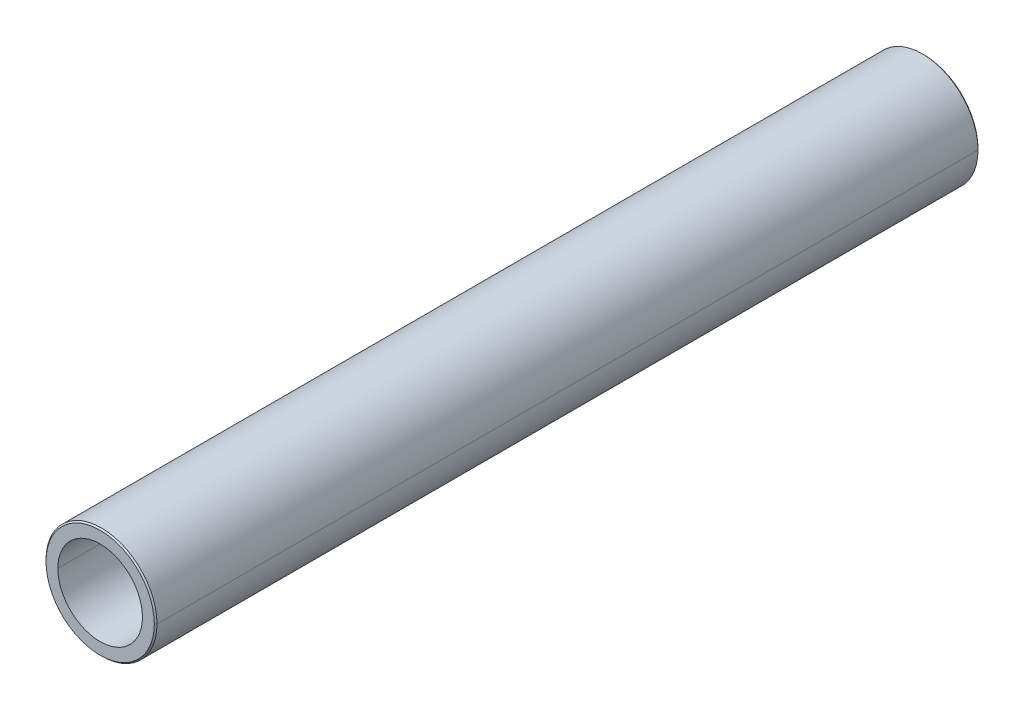
ISO-10303-21;
HEADER;
FILE_DESCRIPTION(('STEP AP214'),'2;1');
FILE_NAME('part.step','',(''),(''),'','','');
FILE_SCHEMA(('AUTOMOTIVE_DESIGN { 1 0 10303 214 1 1 1 1 }'));
ENDSEC;
DATA;
#1=APPLICATION_CONTEXT('core data for automotive mechanical design processes');
#2=APPLICATION_PROTOCOL_DEFINITION('international standard','automotive_design',2000,#1);
#3=PRODUCT_CONTEXT('',#1,'mechanical');
#4=PRODUCT('Part','Part','',(#3));
#5=PRODUCT_RELATED_PRODUCT_CATEGORY('part','',(#4));
#6=PRODUCT_DEFINITION_FORMATION('','',#4);
#7=PRODUCT_DEFINITION_CONTEXT('part definition',#1,'design');
#8=PRODUCT_DEFINITION('design','',#6,#7);
#9=PRODUCT_DEFINITION_SHAPE('','',#8);
#10=(LENGTH_UNIT() NAMED_UNIT(*) SI_UNIT(.MILLI.,.METRE.));
#11=(NAMED_UNIT(*) PLANE_ANGLE_UNIT() SI_UNIT($,.RADIAN.));
#12=(NAMED_UNIT(*) SI_UNIT($,.STERADIAN.) SOLID_ANGLE_UNIT());
#13=UNCERTAINTY_MEASURE_WITH_UNIT(LENGTH_MEASURE(1.E-05),#10,'distance_accuracy_value','');
#14=(GEOMETRIC_REPRESENTATION_CONTEXT(3) GLOBAL_UNCERTAINTY_ASSIGNED_CONTEXT((#13)) GLOBAL_UNIT_ASSIGNED_CONTEXT((#10,
#11,#12)) REPRESENTATION_CONTEXT('',''));
#15=CARTESIAN_POINT('',(0.,0.,0.));
#16=DIRECTION('',(0.,0.,1.));
#17=DIRECTION('',(1.,0.,0.));
#18=AXIS2_PLACEMENT_3D('',#15,#16,#17);
#19=CARTESIAN_POINT('',(0.,12.192,92.7354));
#20=DIRECTION('',(0.,0.,1.));
#21=DIRECTION('',(1.,0.,0.));
#22=AXIS2_PLACEMENT_3D('',#19,#20,#21);
#23=PLANE('',#22);
#24=CARTESIAN_POINT('',(0.,0.,92.7354));
#25=DIRECTION('',(0.,0.,-1.));
#26=DIRECTION('',(-1.,0.,0.));
#27=AXIS2_PLACEMENT_3D('',#24,#25,#26);
#28=CIRCLE('',#27,9.525);
#29=CARTESIAN_POINT('',(-9.525,0.,92.7354));
#30=VERTEX_POINT('',#29);
#31=CARTESIAN_POINT('',(9.525,0.,92.7354));
#32=VERTEX_POINT('',#31);
#33=EDGE_CURVE('E11',#30,#32,#28,.T.);
#34=ORIENTED_EDGE('',*,*,#33,.T.);
#35=CARTESIAN_POINT('',(0.,0.,92.7354));
#36=DIRECTION('',(0.,0.,-1.));
#37=DIRECTION('',(-1.,0.,0.));
#38=AXIS2_PLACEMENT_3D('',#35,#36,#37);
#39=CIRCLE('',#38,9.525);
#40=EDGE_CURVE('E25',#32,#30,#39,.T.);
#41=ORIENTED_EDGE('',*,*,#40,.T.);
#42=EDGE_LOOP('',(#34,#41));
#43=FACE_BOUND('',#42,.T.);
#44=CARTESIAN_POINT('',(0.,0.,92.7354));
#45=DIRECTION('',(0.,0.,-1.));
#46=DIRECTION('',(-1.,0.,0.));
#47=AXIS2_PLACEMENT_3D('',#44,#45,#46);
#48=CIRCLE('',#47,12.192);
#49=CARTESIAN_POINT('',(-12.192,0.,92.7354));
#50=VERTEX_POINT('',#49);
#51=CARTESIAN_POINT('',(12.1919999999992,0.,92.7353999999992));
#52=VERTEX_POINT('',#51);
#53=EDGE_CURVE('E147',#50,#52,#48,.T.);
#54=ORIENTED_EDGE('',*,*,#53,.F.);
#55=CARTESIAN_POINT('',(0.,0.,92.7354));
#56=DIRECTION('',(0.,0.,-1.));
#57=DIRECTION('',(-1.,0.,0.));
#58=AXIS2_PLACEMENT_3D('',#55,#56,#57);
#59=CIRCLE('',#58,12.192);
#60=EDGE_CURVE('E142',#52,#50,#59,.T.);
#61=ORIENTED_EDGE('',*,*,#60,.F.);
#62=EDGE_LOOP('',(#54,#61));
#63=FACE_BOUND('',#62,.T.);
#64=ADVANCED_FACE('F17',(#43,#63),#23,.T.);
#65=CARTESIAN_POINT('',(0.,0.,92.4306));
#66=DIRECTION('',(0.,0.,-1.));
#67=DIRECTION('',(0.,1.,0.));
#68=AXIS2_PLACEMENT_3D('',#65,#66,#67);
#69=CONICAL_SURFACE('',#68,12.4968,0.7853981634);
#70=ORIENTED_EDGE('',*,*,#60,.T.);
#71=DIRECTION('',(-0.707106781188373,0.,-0.707106781184722));
#72=VECTOR('',#71,1.);
#73=CARTESIAN_POINT('',(-12.1919999999992,0.,92.7353999999992));
#74=LINE('',#73,#72);
#75=CARTESIAN_POINT('',(-12.4968,0.,92.4306));
#76=VERTEX_POINT('',#75);
#77=EDGE_CURVE('E138',#50,#76,#74,.T.);
#78=ORIENTED_EDGE('',*,*,#77,.T.);
#79=CARTESIAN_POINT('',(0.,0.,92.4306));
#80=DIRECTION('',(0.,0.,-1.));
#81=DIRECTION('',(-1.,0.,0.));
#82=AXIS2_PLACEMENT_3D('',#79,#80,#81);
#83=CIRCLE('',#82,12.4968);
#84=CARTESIAN_POINT('',(12.4968,0.,92.4306));
#85=VERTEX_POINT('',#84);
#86=EDGE_CURVE('E133',#85,#76,#83,.T.);
#87=ORIENTED_EDGE('',*,*,#86,.F.);
#88=DIRECTION('',(0.707106781188373,0.,-0.707106781184722));
#89=VECTOR('',#88,1.);
#90=CARTESIAN_POINT('',(12.1919999999992,0.,92.7353999999992));
#91=LINE('',#90,#89);
#92=EDGE_CURVE('E128',#52,#85,#91,.T.);
#93=ORIENTED_EDGE('',*,*,#92,.F.);
#94=EDGE_LOOP('',(#70,#78,#87,#93));
#95=FACE_BOUND('',#94,.T.);
#96=ADVANCED_FACE('F163',(#95),#69,.T.);
#97=CARTESIAN_POINT('',(0.,0.,92.4306));
#98=DIRECTION('',(0.,0.,-1.));
#99=DIRECTION('',(0.,-1.,0.));
#100=AXIS2_PLACEMENT_3D('',#97,#98,#99);
#101=CONICAL_SURFACE('',#100,12.4968,0.7853981634);
#102=CARTESIAN_POINT('',(0.,0.,92.4306));
#103=DIRECTION('',(0.,0.,-1.));
#104=DIRECTION('',(-1.,0.,0.));
#105=AXIS2_PLACEMENT_3D('',#102,#103,#104);
#106=CIRCLE('',#105,12.4968);
#107=EDGE_CURVE('E123',#76,#85,#106,.T.);
#108=ORIENTED_EDGE('',*,*,#107,.F.);
#109=ORIENTED_EDGE('',*,*,#77,.F.);
#110=ORIENTED_EDGE('',*,*,#53,.T.);
#111=ORIENTED_EDGE('',*,*,#92,.T.);
#112=EDGE_LOOP('',(#108,#109,#110,#111));
#113=FACE_BOUND('',#112,.T.);
#114=ADVANCED_FACE('F159',(#113),#101,.T.);
#115=CARTESIAN_POINT('',(0.,0.,-92.7354));
#116=DIRECTION('',(0.,0.,1.));
#117=DIRECTION('',(0.,-1.,0.));
#118=AXIS2_PLACEMENT_3D('',#115,#116,#117);
#119=CYLINDRICAL_SURFACE('',#118,12.4968);
#120=CARTESIAN_POINT('',(0.,0.,-92.4306));
#121=DIRECTION('',(0.,0.,-1.));
#122=DIRECTION('',(-1.,0.,0.));
#123=AXIS2_PLACEMENT_3D('',#120,#121,#122);
#124=CIRCLE('',#123,12.4968);
#125=CARTESIAN_POINT('',(-12.4968,0.,-92.4306));
#126=VERTEX_POINT('',#125);
#127=CARTESIAN_POINT('',(12.4968000000008,0.,-92.4306000000008));
#128=VERTEX_POINT('',#127);
#129=EDGE_CURVE('E118',#126,#128,#124,.T.);
#130=ORIENTED_EDGE('',*,*,#129,.F.);
#131=DIRECTION('',(0.,0.,1.));
#132=VECTOR('',#131,1.);
#133=CARTESIAN_POINT('',(-12.4968,0.,-92.4306));
#134=LINE('',#133,#132);
#135=EDGE_CURVE('E113',#126,#76,#134,.T.);
#136=ORIENTED_EDGE('',*,*,#135,.T.);
#137=ORIENTED_EDGE('',*,*,#107,.T.);
#138=DIRECTION('',(0.,0.,1.));
#139=VECTOR('',#138,1.);
#140=CARTESIAN_POINT('',(12.4968,0.,-92.4306));
#141=LINE('',#140,#139);
#142=EDGE_CURVE('E108',#128,#85,#141,.T.);
#143=ORIENTED_EDGE('',*,*,#142,.F.);
#144=EDGE_LOOP('',(#130,#136,#137,#143));
#145=FACE_BOUND('',#144,.T.);
#146=ADVANCED_FACE('F169',(#145),#119,.T.);
#147=CARTESIAN_POINT('',(0.,0.,-92.7354));
#148=DIRECTION('',(0.,0.,1.));
#149=DIRECTION('',(0.,1.,0.));
#150=AXIS2_PLACEMENT_3D('',#147,#148,#149);
#151=CYLINDRICAL_SURFACE('',#150,12.4968);
#152=ORIENTED_EDGE('',*,*,#86,.T.);
#153=ORIENTED_EDGE('',*,*,#135,.F.);
#154=CARTESIAN_POINT('',(0.,0.,-92.4306));
#155=DIRECTION('',(0.,0.,-1.));
#156=DIRECTION('',(-1.,0.,0.));
#157=AXIS2_PLACEMENT_3D('',#154,#155,#156);
#158=CIRCLE('',#157,12.4968);
#159=EDGE_CURVE('E103',#128,#126,#158,.T.);
#160=ORIENTED_EDGE('',*,*,#159,.F.);
#161=ORIENTED_EDGE('',*,*,#142,.T.);
#162=EDGE_LOOP('',(#152,#153,#160,#161));
#163=FACE_BOUND('',#162,.T.);
#164=ADVANCED_FACE('F166',(#163),#151,.T.);
#165=CARTESIAN_POINT('',(0.,0.,-92.7354));
#166=DIRECTION('',(0.,0.,1.));
#167=DIRECTION('',(0.,1.,0.));
#168=AXIS2_PLACEMENT_3D('',#165,#166,#167);
#169=CONICAL_SURFACE('',#168,12.192,0.7853981634);
#170=ORIENTED_EDGE('',*,*,#159,.T.);
#171=DIRECTION('',(-0.707106781188373,0.,0.707106781184722));
#172=VECTOR('',#171,1.);
#173=CARTESIAN_POINT('',(-12.192,0.,-92.7354));
#174=LINE('',#173,#172);
#175=CARTESIAN_POINT('',(-12.192,0.,-92.7354));
#176=VERTEX_POINT('',#175);
#177=EDGE_CURVE('E98',#176,#126,#174,.T.);
#178=ORIENTED_EDGE('',*,*,#177,.F.);
#179=CARTESIAN_POINT('',(0.,0.,-92.7354));
#180=DIRECTION('',(0.,0.,-1.));
#181=DIRECTION('',(-1.,0.,0.));
#182=AXIS2_PLACEMENT_3D('',#179,#180,#181);
#183=CIRCLE('',#182,12.192);
#184=CARTESIAN_POINT('',(12.192,0.,-92.7354));
#185=VERTEX_POINT('',#184);
#186=EDGE_CURVE('E93',#185,#176,#183,.T.);
#187=ORIENTED_EDGE('',*,*,#186,.F.);
#188=DIRECTION('',(0.707106781188373,0.,0.707106781184722));
#189=VECTOR('',#188,1.);
#190=CARTESIAN_POINT('',(12.192,0.,-92.7354));
#191=LINE('',#190,#189);
#192=EDGE_CURVE('E82',#185,#128,#191,.T.);
#193=ORIENTED_EDGE('',*,*,#192,.T.);
#194=EDGE_LOOP('',(#170,#178,#187,#193));
#195=FACE_BOUND('',#194,.T.);
#196=ADVANCED_FACE('F175',(#195),#169,.T.);
#197=CARTESIAN_POINT('',(0.,0.,-92.7354));
#198=DIRECTION('',(0.,0.,1.));
#199=DIRECTION('',(0.,-1.,0.));
#200=AXIS2_PLACEMENT_3D('',#197,#198,#199);
#201=CONICAL_SURFACE('',#200,12.192,0.7853981634);
#202=CARTESIAN_POINT('',(0.,0.,-92.7354));
#203=DIRECTION('',(0.,0.,-1.));
#204=DIRECTION('',(-1.,0.,0.));
#205=AXIS2_PLACEMENT_3D('',#202,#203,#204);
#206=CIRCLE('',#205,12.192);
#207=EDGE_CURVE('E79',#176,#185,#206,.T.);
#208=ORIENTED_EDGE('',*,*,#207,.F.);
#209=ORIENTED_EDGE('',*,*,#177,.T.);
#210=ORIENTED_EDGE('',*,*,#129,.T.);
#211=ORIENTED_EDGE('',*,*,#192,.F.);
#212=EDGE_LOOP('',(#208,#209,#210,#211));
#213=FACE_BOUND('',#212,.T.);
#214=ADVANCED_FACE('F173',(#213),#201,.T.);
#215=CARTESIAN_POINT('',(0.,9.525,-92.7354));
#216=DIRECTION('',(0.,0.,-1.));
#217=DIRECTION('',(-1.,0.,0.));
#218=AXIS2_PLACEMENT_3D('',#215,#216,#217);
#219=PLANE('',#218);
#220=ORIENTED_EDGE('',*,*,#207,.T.);
#221=ORIENTED_EDGE('',*,*,#186,.T.);
#222=EDGE_LOOP('',(#220,#221));
#223=FACE_BOUND('',#222,.T.);
#224=CARTESIAN_POINT('',(0.,0.,-92.7354));
#225=DIRECTION('',(0.,0.,-1.));
#226=DIRECTION('',(-1.,0.,0.));
#227=AXIS2_PLACEMENT_3D('',#224,#225,#226);
#228=CIRCLE('',#227,9.525);
#229=CARTESIAN_POINT('',(-9.525,0.,-92.7354));
#230=VERTEX_POINT('',#229);
#231=CARTESIAN_POINT('',(9.525,0.,-92.7354));
#232=VERTEX_POINT('',#231);
#233=EDGE_CURVE('E68',#230,#232,#228,.T.);
#234=ORIENTED_EDGE('',*,*,#233,.F.);
#235=CARTESIAN_POINT('',(0.,0.,-92.7354));
#236=DIRECTION('',(0.,0.,-1.));
#237=DIRECTION('',(-1.,0.,0.));
#238=AXIS2_PLACEMENT_3D('',#235,#236,#237);
#239=CIRCLE('',#238,9.525);
#240=EDGE_CURVE('E64',#232,#230,#239,.T.);
#241=ORIENTED_EDGE('',*,*,#240,.F.);
#242=EDGE_LOOP('',(#234,#241));
#243=FACE_BOUND('',#242,.T.);
#244=ADVANCED_FACE('F66',(#223,#243),#219,.T.);
#245=CARTESIAN_POINT('',(0.,0.,-92.7354));
#246=DIRECTION('',(0.,0.,1.));
#247=DIRECTION('',(0.,1.,0.));
#248=AXIS2_PLACEMENT_3D('',#245,#246,#247);
#249=CYLINDRICAL_SURFACE('',#248,9.525);
#250=ORIENTED_EDGE('',*,*,#40,.F.);
#251=DIRECTION('',(0.,0.,1.));
#252=VECTOR('',#251,1.);
#253=CARTESIAN_POINT('',(9.525,0.,-92.7354));
#254=LINE('',#253,#252);
#255=EDGE_CURVE('E71',#232,#32,#254,.T.);
#256=ORIENTED_EDGE('',*,*,#255,.F.);
#257=ORIENTED_EDGE('',*,*,#240,.T.);
#258=DIRECTION('',(0.,0.,1.));
#259=VECTOR('',#258,1.);
#260=CARTESIAN_POINT('',(-9.525,0.,-92.7354));
#261=LINE('',#260,#259);
#262=EDGE_CURVE('E76',#230,#30,#261,.T.);
#263=ORIENTED_EDGE('',*,*,#262,.T.);
#264=EDGE_LOOP('',(#250,#256,#257,#263));
#265=FACE_BOUND('',#264,.T.);
#266=ADVANCED_FACE('F74',(#265),#249,.F.);
#267=CARTESIAN_POINT('',(0.,0.,-92.7354));
#268=DIRECTION('',(0.,0.,1.));
#269=DIRECTION('',(0.,-1.,0.));
#270=AXIS2_PLACEMENT_3D('',#267,#268,#269);
#271=CYLINDRICAL_SURFACE('',#270,9.525);
#272=ORIENTED_EDGE('',*,*,#233,.T.);
#273=ORIENTED_EDGE('',*,*,#255,.T.);
#274=ORIENTED_EDGE('',*,*,#33,.F.);
#275=ORIENTED_EDGE('',*,*,#262,.F.);
#276=EDGE_LOOP('',(#272,#273,#274,#275));
#277=FACE_BOUND('',#276,.T.);
#278=ADVANCED_FACE('F78',(#277),#271,.F.);
#279=CLOSED_SHELL('',(#64,#96,#114,#146,#164,#196,#214,#244,#266,#278));
#280=MANIFOLD_SOLID_BREP('B1',#279);
#281=ADVANCED_BREP_SHAPE_REPRESENTATION('',(#18,#280),#14);
#282=SHAPE_DEFINITION_REPRESENTATION(#9,#281);
ENDSEC;
END-ISO-10303-21;
